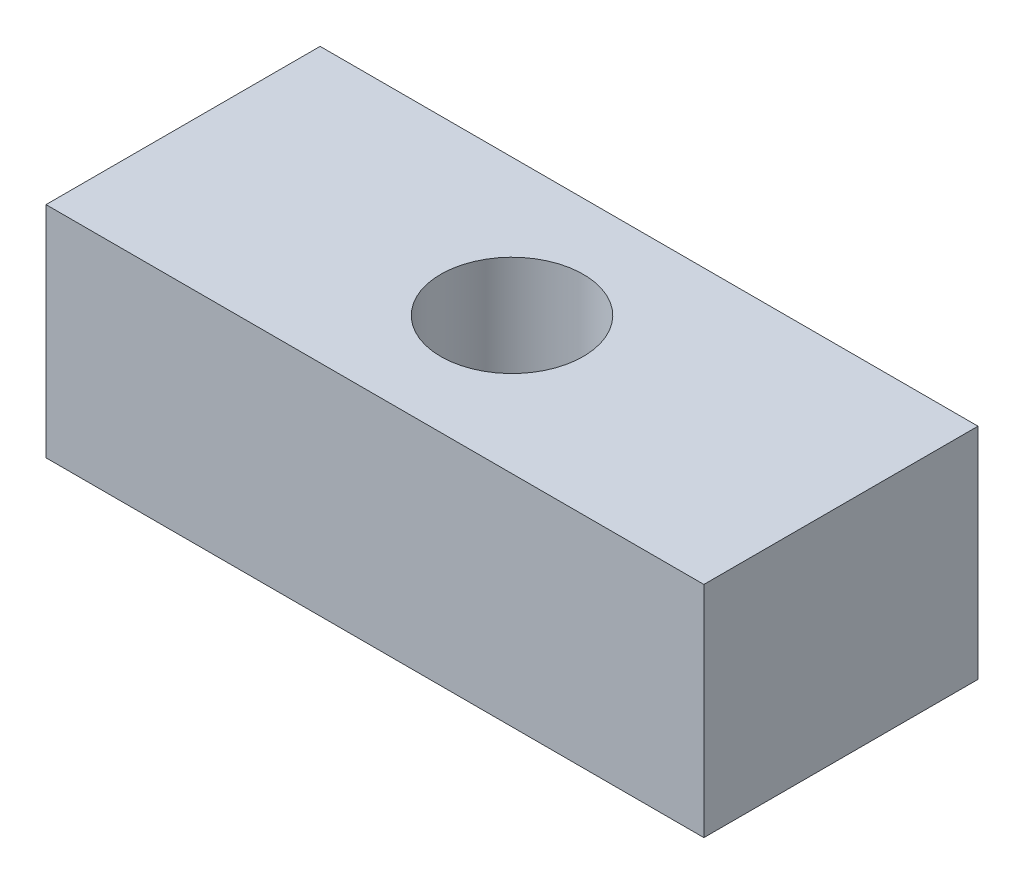
ISO-10303-21;
HEADER;
FILE_DESCRIPTION(('STEP AP214'),'2;1');
FILE_NAME('part.step','',(''),(''),'','','');
FILE_SCHEMA(('AUTOMOTIVE_DESIGN { 1 0 10303 214 1 1 1 1 }'));
ENDSEC;
DATA;
#1=APPLICATION_CONTEXT('core data for automotive mechanical design processes');
#2=APPLICATION_PROTOCOL_DEFINITION('international standard','automotive_design',2000,#1);
#3=PRODUCT_CONTEXT('',#1,'mechanical');
#4=PRODUCT('Part','Part','',(#3));
#5=PRODUCT_RELATED_PRODUCT_CATEGORY('part','',(#4));
#6=PRODUCT_DEFINITION_FORMATION('','',#4);
#7=PRODUCT_DEFINITION_CONTEXT('part definition',#1,'design');
#8=PRODUCT_DEFINITION('design','',#6,#7);
#9=PRODUCT_DEFINITION_SHAPE('','',#8);
#10=(LENGTH_UNIT() NAMED_UNIT(*) SI_UNIT(.MILLI.,.METRE.));
#11=(NAMED_UNIT(*) PLANE_ANGLE_UNIT() SI_UNIT($,.RADIAN.));
#12=(NAMED_UNIT(*) SI_UNIT($,.STERADIAN.) SOLID_ANGLE_UNIT());
#13=UNCERTAINTY_MEASURE_WITH_UNIT(LENGTH_MEASURE(1.E-05),#10,'distance_accuracy_value','');
#14=(GEOMETRIC_REPRESENTATION_CONTEXT(3) GLOBAL_UNCERTAINTY_ASSIGNED_CONTEXT((#13)) GLOBAL_UNIT_ASSIGNED_CONTEXT((#10,
#11,#12)) REPRESENTATION_CONTEXT('',''));
#15=CARTESIAN_POINT('',(0.,0.,0.));
#16=DIRECTION('',(0.,0.,1.));
#17=DIRECTION('',(1.,0.,0.));
#18=AXIS2_PLACEMENT_3D('',#15,#16,#17);
#19=CARTESIAN_POINT('',(-30.,10.,25.));
#20=DIRECTION('',(1.,0.,0.));
#21=DIRECTION('',(0.,0.,-1.));
#22=AXIS2_PLACEMENT_3D('',#19,#20,#21);
#23=PLANE('',#22);
#24=DIRECTION('',(0.,-1.,0.));
#25=VECTOR('',#24,1.);
#26=CARTESIAN_POINT('',(-30.,10.,0.));
#27=LINE('',#26,#25);
#28=CARTESIAN_POINT('',(-30.,10.,0.));
#29=VERTEX_POINT('',#28);
#30=CARTESIAN_POINT('',(-30.,-10.,0.));
#31=VERTEX_POINT('',#30);
#32=EDGE_CURVE('E96',#29,#31,#27,.T.);
#33=ORIENTED_EDGE('',*,*,#32,.T.);
#34=DIRECTION('',(0.,0.,-1.));
#35=VECTOR('',#34,1.);
#36=CARTESIAN_POINT('',(-30.,-10.,25.));
#37=LINE('',#36,#35);
#38=CARTESIAN_POINT('',(-30.,-10.,25.));
#39=VERTEX_POINT('',#38);
#40=EDGE_CURVE('E11',#39,#31,#37,.T.);
#41=ORIENTED_EDGE('',*,*,#40,.F.);
#42=DIRECTION('',(0.,-1.,0.));
#43=VECTOR('',#42,1.);
#44=CARTESIAN_POINT('',(-30.,10.,25.));
#45=LINE('',#44,#43);
#46=CARTESIAN_POINT('',(-30.,10.,25.));
#47=VERTEX_POINT('',#46);
#48=EDGE_CURVE('E82',#47,#39,#45,.T.);
#49=ORIENTED_EDGE('',*,*,#48,.F.);
#50=DIRECTION('',(0.,0.,-1.));
#51=VECTOR('',#50,1.);
#52=CARTESIAN_POINT('',(-30.,10.,25.));
#53=LINE('',#52,#51);
#54=EDGE_CURVE('E49',#47,#29,#53,.T.);
#55=ORIENTED_EDGE('',*,*,#54,.T.);
#56=EDGE_LOOP('',(#33,#41,#49,#55));
#57=FACE_BOUND('',#56,.T.);
#58=ADVANCED_FACE('F33',(#57),#23,.F.);
#59=CARTESIAN_POINT('',(-30.,-10.,25.));
#60=DIRECTION('',(0.,1.,0.));
#61=DIRECTION('',(0.,0.,1.));
#62=AXIS2_PLACEMENT_3D('',#59,#60,#61);
#63=PLANE('',#62);
#64=CARTESIAN_POINT('',(0.,-10.,12.5));
#65=DIRECTION('',(0.,1.,0.));
#66=DIRECTION('',(0.,0.,1.));
#67=AXIS2_PLACEMENT_3D('',#64,#65,#66);
#68=CIRCLE('',#67,6.5);
#69=CARTESIAN_POINT('',(0.,-10.,19.));
#70=VERTEX_POINT('',#69);
#71=EDGE_CURVE('E98',#70,#70,#68,.T.);
#72=ORIENTED_EDGE('',*,*,#71,.T.);
#73=EDGE_LOOP('',(#72));
#74=FACE_BOUND('',#73,.T.);
#75=DIRECTION('',(1.,0.,0.));
#76=VECTOR('',#75,1.);
#77=CARTESIAN_POINT('',(-30.,-10.,0.));
#78=LINE('',#77,#76);
#79=CARTESIAN_POINT('',(30.,-10.,0.));
#80=VERTEX_POINT('',#79);
#81=EDGE_CURVE('E87',#31,#80,#78,.T.);
#82=ORIENTED_EDGE('',*,*,#81,.T.);
#83=DIRECTION('',(0.,0.,-1.));
#84=VECTOR('',#83,1.);
#85=CARTESIAN_POINT('',(30.,-10.,25.));
#86=LINE('',#85,#84);
#87=CARTESIAN_POINT('',(30.,-10.,25.));
#88=VERTEX_POINT('',#87);
#89=EDGE_CURVE('E41',#88,#80,#86,.T.);
#90=ORIENTED_EDGE('',*,*,#89,.F.);
#91=DIRECTION('',(1.,0.,0.));
#92=VECTOR('',#91,1.);
#93=CARTESIAN_POINT('',(-30.,-10.,25.));
#94=LINE('',#93,#92);
#95=EDGE_CURVE('E74',#39,#88,#94,.T.);
#96=ORIENTED_EDGE('',*,*,#95,.F.);
#97=ORIENTED_EDGE('',*,*,#40,.T.);
#98=EDGE_LOOP('',(#82,#90,#96,#97));
#99=FACE_BOUND('',#98,.T.);
#100=ADVANCED_FACE('F86',(#74,#99),#63,.F.);
#101=CARTESIAN_POINT('',(30.,10.,25.));
#102=DIRECTION('',(1.,0.,0.));
#103=DIRECTION('',(0.,1.,0.));
#104=AXIS2_PLACEMENT_3D('',#101,#102,#103);
#105=PLANE('',#104);
#106=DIRECTION('',(0.,-1.,0.));
#107=VECTOR('',#106,1.);
#108=CARTESIAN_POINT('',(30.,10.,0.));
#109=LINE('',#108,#107);
#110=CARTESIAN_POINT('',(30.,10.,0.));
#111=VERTEX_POINT('',#110);
#112=EDGE_CURVE('E100',#111,#80,#109,.T.);
#113=ORIENTED_EDGE('',*,*,#112,.F.);
#114=DIRECTION('',(0.,0.,-1.));
#115=VECTOR('',#114,1.);
#116=CARTESIAN_POINT('',(30.,10.,25.));
#117=LINE('',#116,#115);
#118=CARTESIAN_POINT('',(30.,10.,25.));
#119=VERTEX_POINT('',#118);
#120=EDGE_CURVE('E63',#119,#111,#117,.T.);
#121=ORIENTED_EDGE('',*,*,#120,.F.);
#122=DIRECTION('',(0.,-1.,0.));
#123=VECTOR('',#122,1.);
#124=CARTESIAN_POINT('',(30.,10.,25.));
#125=LINE('',#124,#123);
#126=EDGE_CURVE('E81',#119,#88,#125,.T.);
#127=ORIENTED_EDGE('',*,*,#126,.T.);
#128=ORIENTED_EDGE('',*,*,#89,.T.);
#129=EDGE_LOOP('',(#113,#121,#127,#128));
#130=FACE_BOUND('',#129,.T.);
#131=ADVANCED_FACE('F90',(#130),#105,.T.);
#132=CARTESIAN_POINT('',(-30.,10.,25.));
#133=DIRECTION('',(0.,1.,0.));
#134=DIRECTION('',(0.,0.,1.));
#135=AXIS2_PLACEMENT_3D('',#132,#133,#134);
#136=PLANE('',#135);
#137=CARTESIAN_POINT('',(0.,10.,12.5));
#138=DIRECTION('',(0.,1.,0.));
#139=DIRECTION('',(0.,0.,1.));
#140=AXIS2_PLACEMENT_3D('',#137,#138,#139);
#141=CIRCLE('',#140,6.5);
#142=CARTESIAN_POINT('',(0.,10.,19.));
#143=VERTEX_POINT('',#142);
#144=EDGE_CURVE('E108',#143,#143,#141,.T.);
#145=ORIENTED_EDGE('',*,*,#144,.F.);
#146=EDGE_LOOP('',(#145));
#147=FACE_BOUND('',#146,.T.);
#148=DIRECTION('',(1.,0.,0.));
#149=VECTOR('',#148,1.);
#150=CARTESIAN_POINT('',(-30.,10.,0.));
#151=LINE('',#150,#149);
#152=EDGE_CURVE('E102',#29,#111,#151,.T.);
#153=ORIENTED_EDGE('',*,*,#152,.F.);
#154=ORIENTED_EDGE('',*,*,#54,.F.);
#155=DIRECTION('',(1.,0.,0.));
#156=VECTOR('',#155,1.);
#157=CARTESIAN_POINT('',(-30.,10.,25.));
#158=LINE('',#157,#156);
#159=EDGE_CURVE('E91',#47,#119,#158,.T.);
#160=ORIENTED_EDGE('',*,*,#159,.T.);
#161=ORIENTED_EDGE('',*,*,#120,.T.);
#162=EDGE_LOOP('',(#153,#154,#160,#161));
#163=FACE_BOUND('',#162,.T.);
#164=ADVANCED_FACE('F122',(#147,#163),#136,.T.);
#165=CARTESIAN_POINT('',(0.,0.,25.));
#166=DIRECTION('',(0.,0.,1.));
#167=DIRECTION('',(1.,0.,0.));
#168=AXIS2_PLACEMENT_3D('',#165,#166,#167);
#169=PLANE('',#168);
#170=ORIENTED_EDGE('',*,*,#48,.T.);
#171=ORIENTED_EDGE('',*,*,#95,.T.);
#172=ORIENTED_EDGE('',*,*,#126,.F.);
#173=ORIENTED_EDGE('',*,*,#159,.F.);
#174=EDGE_LOOP('',(#170,#171,#172,#173));
#175=FACE_BOUND('',#174,.T.);
#176=ADVANCED_FACE('F78',(#175),#169,.T.);
#177=CARTESIAN_POINT('',(0.,0.,0.));
#178=DIRECTION('',(0.,0.,1.));
#179=DIRECTION('',(1.,0.,0.));
#180=AXIS2_PLACEMENT_3D('',#177,#178,#179);
#181=PLANE('',#180);
#182=ORIENTED_EDGE('',*,*,#32,.F.);
#183=ORIENTED_EDGE('',*,*,#152,.T.);
#184=ORIENTED_EDGE('',*,*,#112,.T.);
#185=ORIENTED_EDGE('',*,*,#81,.F.);
#186=EDGE_LOOP('',(#182,#183,#184,#185));
#187=FACE_BOUND('',#186,.T.);
#188=ADVANCED_FACE('F118',(#187),#181,.F.);
#189=CARTESIAN_POINT('',(0.,-10.,12.5));
#190=DIRECTION('',(0.,1.,0.));
#191=DIRECTION('',(0.,0.,1.));
#192=AXIS2_PLACEMENT_3D('',#189,#190,#191);
#193=CYLINDRICAL_SURFACE('',#192,6.5);
#194=ORIENTED_EDGE('',*,*,#71,.F.);
#195=EDGE_LOOP('',(#194));
#196=FACE_BOUND('',#195,.T.);
#197=ORIENTED_EDGE('',*,*,#144,.T.);
#198=EDGE_LOOP('',(#197));
#199=FACE_BOUND('',#198,.T.);
#200=ADVANCED_FACE('F115',(#196,#199),#193,.F.);
#201=CLOSED_SHELL('',(#58,#100,#131,#164,#176,#188,#200));
#202=MANIFOLD_SOLID_BREP('B2',#201);
#203=ADVANCED_BREP_SHAPE_REPRESENTATION('',(#18,#202),#14);
#204=SHAPE_DEFINITION_REPRESENTATION(#9,#203);
ENDSEC;
END-ISO-10303-21;
